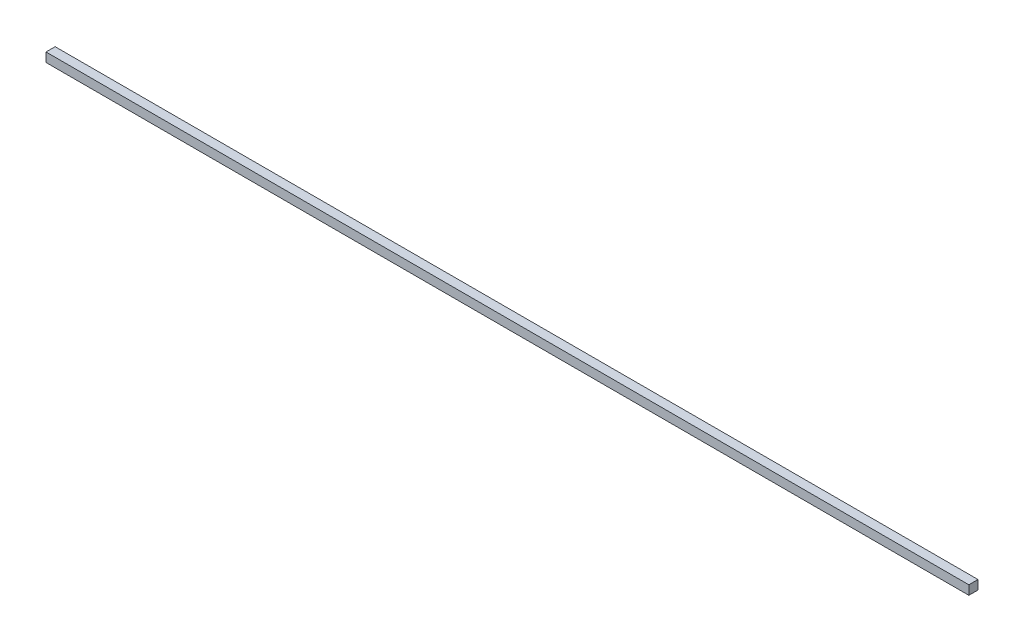
ISO-10303-21;
HEADER;
FILE_DESCRIPTION(('STEP AP214'),'2;1');
FILE_NAME('part.step','',(''),(''),'','','');
FILE_SCHEMA(('AUTOMOTIVE_DESIGN { 1 0 10303 214 1 1 1 1 }'));
ENDSEC;
DATA;
#1=APPLICATION_CONTEXT('core data for automotive mechanical design processes');
#2=APPLICATION_PROTOCOL_DEFINITION('international standard','automotive_design',2000,#1);
#3=PRODUCT_CONTEXT('',#1,'mechanical');
#4=PRODUCT('Part','Part','',(#3));
#5=PRODUCT_RELATED_PRODUCT_CATEGORY('part','',(#4));
#6=PRODUCT_DEFINITION_FORMATION('','',#4);
#7=PRODUCT_DEFINITION_CONTEXT('part definition',#1,'design');
#8=PRODUCT_DEFINITION('design','',#6,#7);
#9=PRODUCT_DEFINITION_SHAPE('','',#8);
#10=(LENGTH_UNIT() NAMED_UNIT(*) SI_UNIT(.MILLI.,.METRE.));
#11=(NAMED_UNIT(*) PLANE_ANGLE_UNIT() SI_UNIT($,.RADIAN.));
#12=(NAMED_UNIT(*) SI_UNIT($,.STERADIAN.) SOLID_ANGLE_UNIT());
#13=UNCERTAINTY_MEASURE_WITH_UNIT(LENGTH_MEASURE(1.E-05),#10,'distance_accuracy_value','');
#14=(GEOMETRIC_REPRESENTATION_CONTEXT(3) GLOBAL_UNCERTAINTY_ASSIGNED_CONTEXT((#13)) GLOBAL_UNIT_ASSIGNED_CONTEXT((#10,
#11,#12)) REPRESENTATION_CONTEXT('',''));
#15=CARTESIAN_POINT('',(0.,0.,0.));
#16=DIRECTION('',(0.,0.,1.));
#17=DIRECTION('',(1.,0.,0.));
#18=AXIS2_PLACEMENT_3D('',#15,#16,#17);
#19=CARTESIAN_POINT('',(-505.,10.,-4.99999999999995));
#20=DIRECTION('',(1.,0.,0.));
#21=DIRECTION('',(0.,0.,-1.));
#22=AXIS2_PLACEMENT_3D('',#19,#20,#21);
#23=PLANE('',#22);
#24=DIRECTION('',(0.,0.,1.));
#25=VECTOR('',#24,1.);
#26=CARTESIAN_POINT('',(-505.,0.,-4.99999999999995));
#27=LINE('',#26,#25);
#28=CARTESIAN_POINT('',(-505.,0.,-4.99999999999995));
#29=VERTEX_POINT('',#28);
#30=CARTESIAN_POINT('',(-505.,0.,5.00000000000006));
#31=VERTEX_POINT('',#30);
#32=EDGE_CURVE('E98',#29,#31,#27,.T.);
#33=ORIENTED_EDGE('',*,*,#32,.T.);
#34=DIRECTION('',(0.,-1.,0.));
#35=VECTOR('',#34,1.);
#36=CARTESIAN_POINT('',(-505.,10.,5.00000000000006));
#37=LINE('',#36,#35);
#38=CARTESIAN_POINT('',(-505.,10.,5.00000000000006));
#39=VERTEX_POINT('',#38);
#40=EDGE_CURVE('E11',#39,#31,#37,.T.);
#41=ORIENTED_EDGE('',*,*,#40,.F.);
#42=DIRECTION('',(0.,0.,1.));
#43=VECTOR('',#42,1.);
#44=CARTESIAN_POINT('',(-505.,10.,-4.99999999999995));
#45=LINE('',#44,#43);
#46=CARTESIAN_POINT('',(-505.,10.,-4.99999999999995));
#47=VERTEX_POINT('',#46);
#48=EDGE_CURVE('E86',#47,#39,#45,.T.);
#49=ORIENTED_EDGE('',*,*,#48,.F.);
#50=DIRECTION('',(0.,-1.,0.));
#51=VECTOR('',#50,1.);
#52=CARTESIAN_POINT('',(-505.,10.,-4.99999999999995));
#53=LINE('',#52,#51);
#54=EDGE_CURVE('E94',#47,#29,#53,.T.);
#55=ORIENTED_EDGE('',*,*,#54,.T.);
#56=EDGE_LOOP('',(#33,#41,#49,#55));
#57=FACE_BOUND('',#56,.T.);
#58=ADVANCED_FACE('F35',(#57),#23,.F.);
#59=CARTESIAN_POINT('',(-505.,10.,5.00000000000006));
#60=DIRECTION('',(0.,0.,-1.));
#61=DIRECTION('',(-1.,0.,0.));
#62=AXIS2_PLACEMENT_3D('',#59,#60,#61);
#63=PLANE('',#62);
#64=DIRECTION('',(1.,0.,0.));
#65=VECTOR('',#64,1.);
#66=CARTESIAN_POINT('',(-505.,0.,5.00000000000006));
#67=LINE('',#66,#65);
#68=CARTESIAN_POINT('',(505.,0.,5.00000000000006));
#69=VERTEX_POINT('',#68);
#70=EDGE_CURVE('E90',#31,#69,#67,.T.);
#71=ORIENTED_EDGE('',*,*,#70,.T.);
#72=DIRECTION('',(0.,-1.,0.));
#73=VECTOR('',#72,1.);
#74=CARTESIAN_POINT('',(505.,10.,5.00000000000006));
#75=LINE('',#74,#73);
#76=CARTESIAN_POINT('',(505.,10.,5.00000000000006));
#77=VERTEX_POINT('',#76);
#78=EDGE_CURVE('E43',#77,#69,#75,.T.);
#79=ORIENTED_EDGE('',*,*,#78,.F.);
#80=DIRECTION('',(1.,0.,0.));
#81=VECTOR('',#80,1.);
#82=CARTESIAN_POINT('',(-505.,10.,5.00000000000006));
#83=LINE('',#82,#81);
#84=EDGE_CURVE('E81',#39,#77,#83,.T.);
#85=ORIENTED_EDGE('',*,*,#84,.F.);
#86=ORIENTED_EDGE('',*,*,#40,.T.);
#87=EDGE_LOOP('',(#71,#79,#85,#86));
#88=FACE_BOUND('',#87,.T.);
#89=ADVANCED_FACE('F89',(#88),#63,.F.);
#90=CARTESIAN_POINT('',(505.,10.,-4.99999999999995));
#91=DIRECTION('',(-1.,0.,0.));
#92=DIRECTION('',(0.,0.,1.));
#93=AXIS2_PLACEMENT_3D('',#90,#91,#92);
#94=PLANE('',#93);
#95=DIRECTION('',(0.,0.,-1.));
#96=VECTOR('',#95,1.);
#97=CARTESIAN_POINT('',(505.,0.,-4.99999999999995));
#98=LINE('',#97,#96);
#99=CARTESIAN_POINT('',(505.,0.,-4.99999999999995));
#100=VERTEX_POINT('',#99);
#101=EDGE_CURVE('E68',#69,#100,#98,.T.);
#102=ORIENTED_EDGE('',*,*,#101,.T.);
#103=DIRECTION('',(0.,-1.,0.));
#104=VECTOR('',#103,1.);
#105=CARTESIAN_POINT('',(505.,10.,-4.99999999999995));
#106=LINE('',#105,#104);
#107=CARTESIAN_POINT('',(505.,10.,-4.99999999999995));
#108=VERTEX_POINT('',#107);
#109=EDGE_CURVE('E91',#108,#100,#106,.T.);
#110=ORIENTED_EDGE('',*,*,#109,.F.);
#111=DIRECTION('',(0.,0.,-1.));
#112=VECTOR('',#111,1.);
#113=CARTESIAN_POINT('',(505.,10.,-4.99999999999995));
#114=LINE('',#113,#112);
#115=EDGE_CURVE('E84',#77,#108,#114,.T.);
#116=ORIENTED_EDGE('',*,*,#115,.F.);
#117=ORIENTED_EDGE('',*,*,#78,.T.);
#118=EDGE_LOOP('',(#102,#110,#116,#117));
#119=FACE_BOUND('',#118,.T.);
#120=ADVANCED_FACE('F92',(#119),#94,.F.);
#121=CARTESIAN_POINT('',(-505.,10.,-4.99999999999995));
#122=DIRECTION('',(0.,0.,1.));
#123=DIRECTION('',(1.,0.,0.));
#124=AXIS2_PLACEMENT_3D('',#121,#122,#123);
#125=PLANE('',#124);
#126=DIRECTION('',(-1.,0.,0.));
#127=VECTOR('',#126,1.);
#128=CARTESIAN_POINT('',(-505.,0.,-4.99999999999995));
#129=LINE('',#128,#127);
#130=EDGE_CURVE('E74',#100,#29,#129,.T.);
#131=ORIENTED_EDGE('',*,*,#130,.T.);
#132=ORIENTED_EDGE('',*,*,#54,.F.);
#133=DIRECTION('',(-1.,0.,0.));
#134=VECTOR('',#133,1.);
#135=CARTESIAN_POINT('',(-505.,10.,-4.99999999999995));
#136=LINE('',#135,#134);
#137=EDGE_CURVE('E51',#108,#47,#136,.T.);
#138=ORIENTED_EDGE('',*,*,#137,.F.);
#139=ORIENTED_EDGE('',*,*,#109,.T.);
#140=EDGE_LOOP('',(#131,#132,#138,#139));
#141=FACE_BOUND('',#140,.T.);
#142=ADVANCED_FACE('F105',(#141),#125,.F.);
#143=CARTESIAN_POINT('',(0.,10.,0.));
#144=DIRECTION('',(0.,1.,0.));
#145=DIRECTION('',(0.,0.,1.));
#146=AXIS2_PLACEMENT_3D('',#143,#144,#145);
#147=PLANE('',#146);
#148=ORIENTED_EDGE('',*,*,#48,.T.);
#149=ORIENTED_EDGE('',*,*,#84,.T.);
#150=ORIENTED_EDGE('',*,*,#115,.T.);
#151=ORIENTED_EDGE('',*,*,#137,.T.);
#152=EDGE_LOOP('',(#148,#149,#150,#151));
#153=FACE_BOUND('',#152,.T.);
#154=ADVANCED_FACE('F82',(#153),#147,.T.);
#155=CARTESIAN_POINT('',(0.,0.,0.));
#156=DIRECTION('',(0.,1.,0.));
#157=DIRECTION('',(0.,0.,1.));
#158=AXIS2_PLACEMENT_3D('',#155,#156,#157);
#159=PLANE('',#158);
#160=ORIENTED_EDGE('',*,*,#32,.F.);
#161=ORIENTED_EDGE('',*,*,#130,.F.);
#162=ORIENTED_EDGE('',*,*,#101,.F.);
#163=ORIENTED_EDGE('',*,*,#70,.F.);
#164=EDGE_LOOP('',(#160,#161,#162,#163));
#165=FACE_BOUND('',#164,.T.);
#166=ADVANCED_FACE('F108',(#165),#159,.F.);
#167=CLOSED_SHELL('',(#58,#89,#120,#142,#154,#166));
#168=MANIFOLD_SOLID_BREP('B2',#167);
#169=ADVANCED_BREP_SHAPE_REPRESENTATION('',(#18,#168),#14);
#170=SHAPE_DEFINITION_REPRESENTATION(#9,#169);
ENDSEC;
END-ISO-10303-21;
